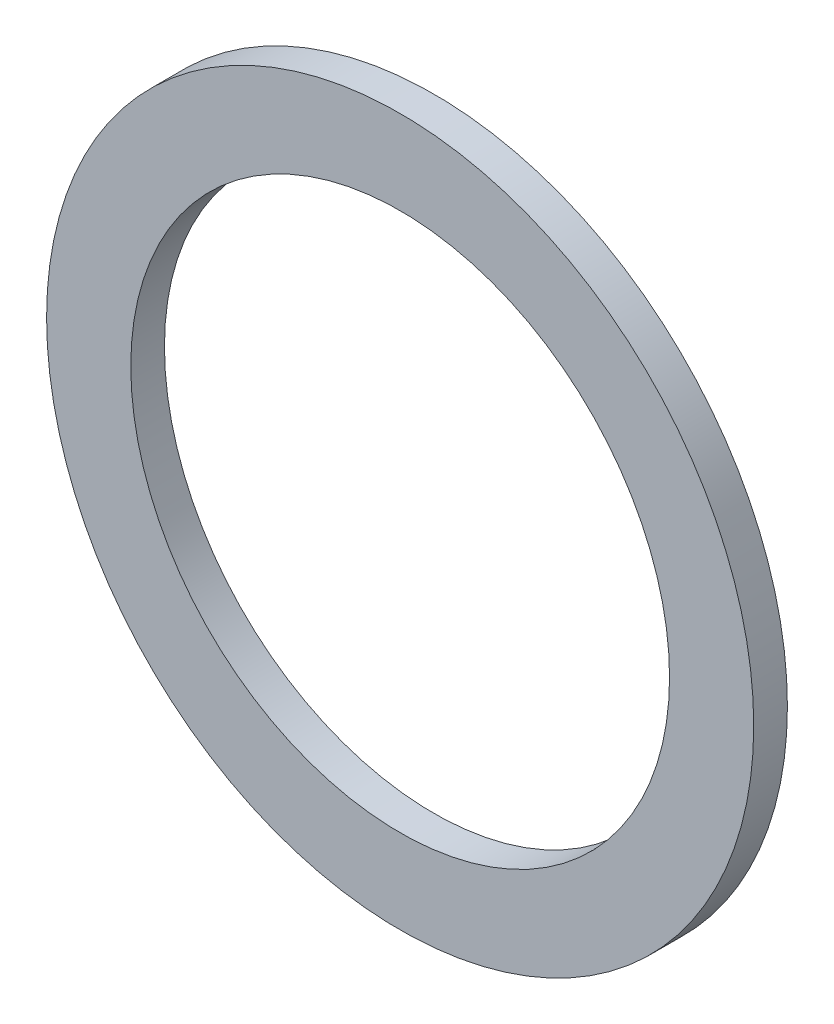
ISO-10303-21;
HEADER;
FILE_DESCRIPTION(('STEP AP214'),'2;1');
FILE_NAME('part.step','',(''),(''),'','','');
FILE_SCHEMA(('AUTOMOTIVE_DESIGN { 1 0 10303 214 1 1 1 1 }'));
ENDSEC;
DATA;
#1=APPLICATION_CONTEXT('core data for automotive mechanical design processes');
#2=APPLICATION_PROTOCOL_DEFINITION('international standard','automotive_design',2000,#1);
#3=PRODUCT_CONTEXT('',#1,'mechanical');
#4=PRODUCT('Part','Part','',(#3));
#5=PRODUCT_RELATED_PRODUCT_CATEGORY('part','',(#4));
#6=PRODUCT_DEFINITION_FORMATION('','',#4);
#7=PRODUCT_DEFINITION_CONTEXT('part definition',#1,'design');
#8=PRODUCT_DEFINITION('design','',#6,#7);
#9=PRODUCT_DEFINITION_SHAPE('','',#8);
#10=(LENGTH_UNIT() NAMED_UNIT(*) SI_UNIT(.MILLI.,.METRE.));
#11=(NAMED_UNIT(*) PLANE_ANGLE_UNIT() SI_UNIT($,.RADIAN.));
#12=(NAMED_UNIT(*) SI_UNIT($,.STERADIAN.) SOLID_ANGLE_UNIT());
#13=UNCERTAINTY_MEASURE_WITH_UNIT(LENGTH_MEASURE(1.E-05),#10,'distance_accuracy_value','');
#14=(GEOMETRIC_REPRESENTATION_CONTEXT(3) GLOBAL_UNCERTAINTY_ASSIGNED_CONTEXT((#13)) GLOBAL_UNIT_ASSIGNED_CONTEXT((#10,
#11,#12)) REPRESENTATION_CONTEXT('',''));
#15=CARTESIAN_POINT('',(0.,0.,0.));
#16=DIRECTION('',(0.,0.,1.));
#17=DIRECTION('',(1.,0.,0.));
#18=AXIS2_PLACEMENT_3D('',#15,#16,#17);
#19=CARTESIAN_POINT('',(0.,0.,0.5));
#20=DIRECTION('',(0.,0.,1.));
#21=DIRECTION('',(1.,0.,0.));
#22=AXIS2_PLACEMENT_3D('',#19,#20,#21);
#23=PLANE('',#22);
#24=CARTESIAN_POINT('',(0.,0.,0.5));
#25=DIRECTION('',(0.,0.,1.));
#26=DIRECTION('',(1.,0.,0.));
#27=AXIS2_PLACEMENT_3D('',#24,#25,#26);
#28=CIRCLE('',#27,10.5);
#29=CARTESIAN_POINT('',(10.5,0.,0.5));
#30=VERTEX_POINT('',#29);
#31=EDGE_CURVE('E10',#30,#30,#28,.T.);
#32=ORIENTED_EDGE('',*,*,#31,.T.);
#33=EDGE_LOOP('',(#32));
#34=FACE_BOUND('',#33,.T.);
#35=CARTESIAN_POINT('',(0.,0.,0.5));
#36=DIRECTION('',(0.,0.,1.));
#37=DIRECTION('',(1.,0.,0.));
#38=AXIS2_PLACEMENT_3D('',#35,#36,#37);
#39=CIRCLE('',#38,8.);
#40=CARTESIAN_POINT('',(8.,0.,0.5));
#41=VERTEX_POINT('',#40);
#42=EDGE_CURVE('E45',#41,#41,#39,.T.);
#43=ORIENTED_EDGE('',*,*,#42,.F.);
#44=EDGE_LOOP('',(#43));
#45=FACE_BOUND('',#44,.T.);
#46=ADVANCED_FACE('F34',(#34,#45),#23,.T.);
#47=CARTESIAN_POINT('',(0.,0.,-0.5));
#48=DIRECTION('',(0.,0.,1.));
#49=DIRECTION('',(1.,0.,0.));
#50=AXIS2_PLACEMENT_3D('',#47,#48,#49);
#51=PLANE('',#50);
#52=CARTESIAN_POINT('',(0.,0.,-0.5));
#53=DIRECTION('',(0.,0.,1.));
#54=DIRECTION('',(1.,0.,0.));
#55=AXIS2_PLACEMENT_3D('',#52,#53,#54);
#56=CIRCLE('',#55,10.5);
#57=CARTESIAN_POINT('',(10.5,0.,-0.5));
#58=VERTEX_POINT('',#57);
#59=EDGE_CURVE('E38',#58,#58,#56,.T.);
#60=ORIENTED_EDGE('',*,*,#59,.F.);
#61=EDGE_LOOP('',(#60));
#62=FACE_BOUND('',#61,.T.);
#63=CARTESIAN_POINT('',(0.,0.,-0.5));
#64=DIRECTION('',(0.,0.,1.));
#65=DIRECTION('',(1.,0.,0.));
#66=AXIS2_PLACEMENT_3D('',#63,#64,#65);
#67=CIRCLE('',#66,8.);
#68=CARTESIAN_POINT('',(8.,0.,-0.5));
#69=VERTEX_POINT('',#68);
#70=EDGE_CURVE('E47',#69,#69,#67,.T.);
#71=ORIENTED_EDGE('',*,*,#70,.T.);
#72=EDGE_LOOP('',(#71));
#73=FACE_BOUND('',#72,.T.);
#74=ADVANCED_FACE('F57',(#62,#73),#51,.F.);
#75=CARTESIAN_POINT('',(0.,0.,0.5));
#76=DIRECTION('',(0.,0.,-1.));
#77=DIRECTION('',(-1.,0.,0.));
#78=AXIS2_PLACEMENT_3D('',#75,#76,#77);
#79=CYLINDRICAL_SURFACE('',#78,10.5);
#80=ORIENTED_EDGE('',*,*,#31,.F.);
#81=EDGE_LOOP('',(#80));
#82=FACE_BOUND('',#81,.T.);
#83=ORIENTED_EDGE('',*,*,#59,.T.);
#84=EDGE_LOOP('',(#83));
#85=FACE_BOUND('',#84,.T.);
#86=ADVANCED_FACE('F36',(#82,#85),#79,.T.);
#87=CARTESIAN_POINT('',(0.,0.,0.5));
#88=DIRECTION('',(0.,0.,-1.));
#89=DIRECTION('',(-1.,0.,0.));
#90=AXIS2_PLACEMENT_3D('',#87,#88,#89);
#91=CYLINDRICAL_SURFACE('',#90,8.);
#92=ORIENTED_EDGE('',*,*,#42,.T.);
#93=EDGE_LOOP('',(#92));
#94=FACE_BOUND('',#93,.T.);
#95=ORIENTED_EDGE('',*,*,#70,.F.);
#96=EDGE_LOOP('',(#95));
#97=FACE_BOUND('',#96,.T.);
#98=ADVANCED_FACE('F53',(#94,#97),#91,.F.);
#99=CLOSED_SHELL('',(#46,#74,#86,#98));
#100=MANIFOLD_SOLID_BREP('B2',#99);
#101=ADVANCED_BREP_SHAPE_REPRESENTATION('',(#18,#100),#14);
#102=SHAPE_DEFINITION_REPRESENTATION(#9,#101);
ENDSEC;
END-ISO-10303-21;
